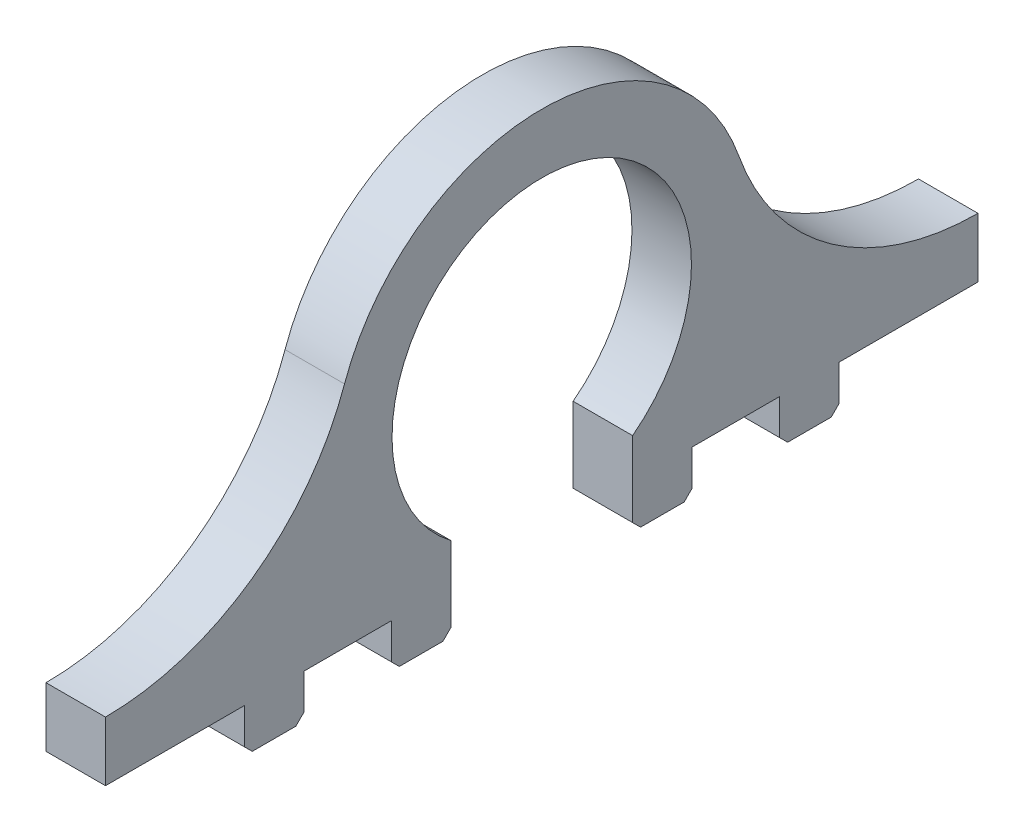
ISO-10303-21;
HEADER;
FILE_DESCRIPTION(('STEP AP214'),'2;1');
FILE_NAME('part.step','',(''),(''),'','','');
FILE_SCHEMA(('AUTOMOTIVE_DESIGN { 1 0 10303 214 1 1 1 1 }'));
ENDSEC;
DATA;
#1=APPLICATION_CONTEXT('core data for automotive mechanical design processes');
#2=APPLICATION_PROTOCOL_DEFINITION('international standard','automotive_design',2000,#1);
#3=PRODUCT_CONTEXT('',#1,'mechanical');
#4=PRODUCT('Part','Part','',(#3));
#5=PRODUCT_RELATED_PRODUCT_CATEGORY('part','',(#4));
#6=PRODUCT_DEFINITION_FORMATION('','',#4);
#7=PRODUCT_DEFINITION_CONTEXT('part definition',#1,'design');
#8=PRODUCT_DEFINITION('design','',#6,#7);
#9=PRODUCT_DEFINITION_SHAPE('','',#8);
#10=(LENGTH_UNIT() NAMED_UNIT(*) SI_UNIT(.MILLI.,.METRE.));
#11=(NAMED_UNIT(*) PLANE_ANGLE_UNIT() SI_UNIT($,.RADIAN.));
#12=(NAMED_UNIT(*) SI_UNIT($,.STERADIAN.) SOLID_ANGLE_UNIT());
#13=UNCERTAINTY_MEASURE_WITH_UNIT(LENGTH_MEASURE(1.E-05),#10,'distance_accuracy_value','');
#14=(GEOMETRIC_REPRESENTATION_CONTEXT(3) GLOBAL_UNCERTAINTY_ASSIGNED_CONTEXT((#13)) GLOBAL_UNIT_ASSIGNED_CONTEXT((#10,
#11,#12)) REPRESENTATION_CONTEXT('',''));
#15=CARTESIAN_POINT('',(0.,0.,0.));
#16=DIRECTION('',(0.,0.,1.));
#17=DIRECTION('',(1.,0.,0.));
#18=AXIS2_PLACEMENT_3D('',#15,#16,#17);
#19=CARTESIAN_POINT('',(0.,-40.,-22.9142422960045));
#20=DIRECTION('',(0.,-1.,0.));
#21=DIRECTION('',(0.,0.,-1.));
#22=AXIS2_PLACEMENT_3D('',#19,#20,#21);
#23=PLANE('',#22);
#24=CARTESIAN_POINT('',(0.,-40.,-75.));
#25=CARTESIAN_POINT('',(15.,-40.,-75.));
#26=B_SPLINE_CURVE_WITH_KNOTS('',1,(#24,#25),.UNSPECIFIED.,.F.,.F.,(2,2),(0.,0.25),.UNSPECIFIED.);
#27=CARTESIAN_POINT('',(0.,-40.,-75.));
#28=VERTEX_POINT('',#27);
#29=CARTESIAN_POINT('',(15.,-40.,-75.));
#30=VERTEX_POINT('',#29);
#31=EDGE_CURVE('E65',#28,#30,#26,.T.);
#32=ORIENTED_EDGE('',*,*,#31,.F.);
#33=DIRECTION('',(0.,0.,-1.));
#34=VECTOR('',#33,1.);
#35=CARTESIAN_POINT('',(0.,-40.,-22.9142422960045));
#36=LINE('',#35,#34);
#37=CARTESIAN_POINT('',(0.,-40.,-110.));
#38=VERTEX_POINT('',#37);
#39=EDGE_CURVE('E510',#28,#38,#36,.T.);
#40=ORIENTED_EDGE('',*,*,#39,.T.);
#41=DIRECTION('',(-1.,0.,0.));
#42=VECTOR('',#41,1.);
#43=CARTESIAN_POINT('',(0.,-40.,-110.));
#44=LINE('',#43,#42);
#45=CARTESIAN_POINT('',(15.,-40.,-110.));
#46=VERTEX_POINT('',#45);
#47=EDGE_CURVE('E564',#46,#38,#44,.T.);
#48=ORIENTED_EDGE('',*,*,#47,.F.);
#49=DIRECTION('',(0.,0.,-1.));
#50=VECTOR('',#49,1.);
#51=CARTESIAN_POINT('',(15.,-40.,0.));
#52=LINE('',#51,#50);
#53=EDGE_CURVE('E246',#30,#46,#52,.T.);
#54=ORIENTED_EDGE('',*,*,#53,.F.);
#55=EDGE_LOOP('',(#32,#40,#48,#54));
#56=FACE_BOUND('',#55,.T.);
#57=ADVANCED_FACE('F40',(#56),#23,.T.);
#58=CARTESIAN_POINT('',(0.,-40.,110.));
#59=DIRECTION('',(0.,-1.,0.));
#60=DIRECTION('',(0.,0.,-1.));
#61=AXIS2_PLACEMENT_3D('',#58,#59,#60);
#62=PLANE('',#61);
#63=DIRECTION('',(0.,0.,-1.));
#64=VECTOR('',#63,1.);
#65=CARTESIAN_POINT('',(0.,-40.,110.));
#66=LINE('',#65,#64);
#67=CARTESIAN_POINT('',(0.,-40.,60.));
#68=VERTEX_POINT('',#67);
#69=CARTESIAN_POINT('',(0.,-40.,37.9142422960045));
#70=VERTEX_POINT('',#69);
#71=EDGE_CURVE('E490',#68,#70,#66,.T.);
#72=ORIENTED_EDGE('',*,*,#71,.T.);
#73=CARTESIAN_POINT('',(0.,-40.,37.9142422960045));
#74=CARTESIAN_POINT('',(15.,-40.,37.9142422960045));
#75=B_SPLINE_CURVE_WITH_KNOTS('',1,(#73,#74),.UNSPECIFIED.,.F.,.F.,(2,2),(0.,0.25),.UNSPECIFIED.);
#76=CARTESIAN_POINT('',(15.,-40.,37.9142422960045));
#77=VERTEX_POINT('',#76);
#78=EDGE_CURVE('E369',#70,#77,#75,.T.);
#79=ORIENTED_EDGE('',*,*,#78,.T.);
#80=DIRECTION('',(0.,0.,-1.));
#81=VECTOR('',#80,1.);
#82=CARTESIAN_POINT('',(15.,-40.,0.));
#83=LINE('',#82,#81);
#84=CARTESIAN_POINT('',(15.,-40.,60.));
#85=VERTEX_POINT('',#84);
#86=EDGE_CURVE('E484',#85,#77,#83,.T.);
#87=ORIENTED_EDGE('',*,*,#86,.F.);
#88=CARTESIAN_POINT('',(15.,-40.,60.));
#89=CARTESIAN_POINT('',(0.,-40.,60.));
#90=B_SPLINE_CURVE_WITH_KNOTS('',1,(#88,#89),.UNSPECIFIED.,.F.,.F.,(2,2),(0.5,0.75),.UNSPECIFIED.);
#91=EDGE_CURVE('E432',#85,#68,#90,.T.);
#92=ORIENTED_EDGE('',*,*,#91,.T.);
#93=EDGE_LOOP('',(#72,#79,#87,#92));
#94=FACE_BOUND('',#93,.T.);
#95=ADVANCED_FACE('F632',(#94),#62,.T.);
#96=CARTESIAN_POINT('',(0.,-40.,110.));
#97=VERTEX_POINT('',#96);
#98=CARTESIAN_POINT('',(0.,-40.,75.));
#99=VERTEX_POINT('',#98);
#100=EDGE_CURVE('E485',#97,#99,#66,.T.);
#101=ORIENTED_EDGE('',*,*,#100,.T.);
#102=CARTESIAN_POINT('',(0.,-40.,75.));
#103=CARTESIAN_POINT('',(15.,-40.,75.));
#104=B_SPLINE_CURVE_WITH_KNOTS('',1,(#102,#103),.UNSPECIFIED.,.F.,.F.,(2,2),(0.,0.25),.UNSPECIFIED.);
#105=CARTESIAN_POINT('',(15.,-40.,75.));
#106=VERTEX_POINT('',#105);
#107=EDGE_CURVE('E420',#99,#106,#104,.T.);
#108=ORIENTED_EDGE('',*,*,#107,.T.);
#109=CARTESIAN_POINT('',(15.,-40.,110.));
#110=VERTEX_POINT('',#109);
#111=EDGE_CURVE('E525',#110,#106,#83,.T.);
#112=ORIENTED_EDGE('',*,*,#111,.F.);
#113=DIRECTION('',(-1.,0.,0.));
#114=VECTOR('',#113,1.);
#115=CARTESIAN_POINT('',(0.,-40.,110.));
#116=LINE('',#115,#114);
#117=EDGE_CURVE('E44',#110,#97,#116,.T.);
#118=ORIENTED_EDGE('',*,*,#117,.T.);
#119=EDGE_LOOP('',(#101,#108,#112,#118));
#120=FACE_BOUND('',#119,.T.);
#121=ADVANCED_FACE('F637',(#120),#62,.T.);
#122=CARTESIAN_POINT('',(0.,38.9385048231511,110.));
#123=DIRECTION('',(1.,0.,0.));
#124=DIRECTION('',(0.,0.,-1.));
#125=AXIS2_PLACEMENT_3D('',#122,#123,#124);
#126=CYLINDRICAL_SURFACE('',#125,63.9385048231511);
#127=DIRECTION('',(-1.,0.,0.));
#128=VECTOR('',#127,1.);
#129=CARTESIAN_POINT('',(0.,-25.,110.));
#130=LINE('',#129,#128);
#131=CARTESIAN_POINT('',(15.,-25.,110.));
#132=VERTEX_POINT('',#131);
#133=CARTESIAN_POINT('',(0.,-25.,110.));
#134=VERTEX_POINT('',#133);
#135=EDGE_CURVE('E11',#132,#134,#130,.T.);
#136=ORIENTED_EDGE('',*,*,#135,.F.);
#137=CARTESIAN_POINT('',(15.,38.9385048231511,110.));
#138=DIRECTION('',(-1.,0.,0.));
#139=DIRECTION('',(0.,0.,1.));
#140=AXIS2_PLACEMENT_3D('',#137,#138,#139);
#141=CIRCLE('',#140,63.9385048231511);
#142=CARTESIAN_POINT('',(15.,17.6024719190138,49.726406288212));
#143=VERTEX_POINT('',#142);
#144=EDGE_CURVE('E551',#143,#132,#141,.T.);
#145=ORIENTED_EDGE('',*,*,#144,.F.);
#146=DIRECTION('',(-1.,0.,0.));
#147=VECTOR('',#146,1.);
#148=CARTESIAN_POINT('',(0.,17.6024719190138,49.726406288212));
#149=LINE('',#148,#147);
#150=CARTESIAN_POINT('',(0.,17.6024719190138,49.726406288212));
#151=VERTEX_POINT('',#150);
#152=EDGE_CURVE('E50',#143,#151,#149,.T.);
#153=ORIENTED_EDGE('',*,*,#152,.T.);
#154=CARTESIAN_POINT('',(0.,38.9385048231511,110.));
#155=DIRECTION('',(-1.,0.,0.));
#156=DIRECTION('',(0.,0.,-1.));
#157=AXIS2_PLACEMENT_3D('',#154,#155,#156);
#158=CIRCLE('',#157,63.9385048231511);
#159=EDGE_CURVE('E494',#151,#134,#158,.T.);
#160=ORIENTED_EDGE('',*,*,#159,.T.);
#161=EDGE_LOOP('',(#136,#145,#153,#160));
#162=FACE_BOUND('',#161,.T.);
#163=ADVANCED_FACE('F579',(#162),#126,.F.);
#164=CARTESIAN_POINT('',(0.,0.,0.));
#165=DIRECTION('',(1.,0.,0.));
#166=DIRECTION('',(0.,0.,-1.));
#167=AXIS2_PLACEMENT_3D('',#164,#165,#166);
#168=CYLINDRICAL_SURFACE('',#167,52.75);
#169=ORIENTED_EDGE('',*,*,#152,.F.);
#170=CARTESIAN_POINT('',(15.,0.,0.));
#171=DIRECTION('',(1.,0.,0.));
#172=DIRECTION('',(0.,0.,-1.));
#173=AXIS2_PLACEMENT_3D('',#170,#171,#172);
#174=CIRCLE('',#173,52.75);
#175=CARTESIAN_POINT('',(15.,17.6024719190138,-49.726406288212));
#176=VERTEX_POINT('',#175);
#177=EDGE_CURVE('E547',#176,#143,#174,.T.);
#178=ORIENTED_EDGE('',*,*,#177,.F.);
#179=DIRECTION('',(-1.,0.,0.));
#180=VECTOR('',#179,1.);
#181=CARTESIAN_POINT('',(0.,17.6024719190138,-49.726406288212));
#182=LINE('',#181,#180);
#183=CARTESIAN_POINT('',(0.,17.6024719190138,-49.726406288212));
#184=VERTEX_POINT('',#183);
#185=EDGE_CURVE('E571',#176,#184,#182,.T.);
#186=ORIENTED_EDGE('',*,*,#185,.T.);
#187=CARTESIAN_POINT('',(0.,0.,0.));
#188=DIRECTION('',(1.,0.,0.));
#189=DIRECTION('',(0.,0.,1.));
#190=AXIS2_PLACEMENT_3D('',#187,#188,#189);
#191=CIRCLE('',#190,52.75);
#192=EDGE_CURVE('E498',#184,#151,#191,.T.);
#193=ORIENTED_EDGE('',*,*,#192,.T.);
#194=EDGE_LOOP('',(#169,#178,#186,#193));
#195=FACE_BOUND('',#194,.T.);
#196=ADVANCED_FACE('F588',(#195),#168,.T.);
#197=CARTESIAN_POINT('',(0.,38.9385048231511,-110.));
#198=DIRECTION('',(1.,0.,0.));
#199=DIRECTION('',(0.,0.,-1.));
#200=AXIS2_PLACEMENT_3D('',#197,#198,#199);
#201=CYLINDRICAL_SURFACE('',#200,63.9385048231511);
#202=ORIENTED_EDGE('',*,*,#185,.F.);
#203=CARTESIAN_POINT('',(15.,38.9385048231511,-110.));
#204=DIRECTION('',(-1.,0.,0.));
#205=DIRECTION('',(0.,0.,1.));
#206=AXIS2_PLACEMENT_3D('',#203,#204,#205);
#207=CIRCLE('',#206,63.9385048231511);
#208=CARTESIAN_POINT('',(15.,-25.,-110.));
#209=VERTEX_POINT('',#208);
#210=EDGE_CURVE('E543',#209,#176,#207,.T.);
#211=ORIENTED_EDGE('',*,*,#210,.F.);
#212=DIRECTION('',(-1.,0.,0.));
#213=VECTOR('',#212,1.);
#214=CARTESIAN_POINT('',(0.,-25.,-110.));
#215=LINE('',#214,#213);
#216=CARTESIAN_POINT('',(0.,-25.,-110.));
#217=VERTEX_POINT('',#216);
#218=EDGE_CURVE('E568',#209,#217,#215,.T.);
#219=ORIENTED_EDGE('',*,*,#218,.T.);
#220=CARTESIAN_POINT('',(0.,38.9385048231511,-110.));
#221=DIRECTION('',(-1.,0.,0.));
#222=DIRECTION('',(0.,0.,1.));
#223=AXIS2_PLACEMENT_3D('',#220,#221,#222);
#224=CIRCLE('',#223,63.9385048231511);
#225=EDGE_CURVE('E502',#217,#184,#224,.T.);
#226=ORIENTED_EDGE('',*,*,#225,.T.);
#227=EDGE_LOOP('',(#202,#211,#219,#226));
#228=FACE_BOUND('',#227,.T.);
#229=ADVANCED_FACE('F591',(#228),#201,.F.);
#230=CARTESIAN_POINT('',(0.,-40.,-110.));
#231=DIRECTION('',(0.,0.,-1.));
#232=DIRECTION('',(0.,1.,0.));
#233=AXIS2_PLACEMENT_3D('',#230,#231,#232);
#234=PLANE('',#233);
#235=ORIENTED_EDGE('',*,*,#218,.F.);
#236=DIRECTION('',(0.,1.,0.));
#237=VECTOR('',#236,1.);
#238=CARTESIAN_POINT('',(15.,0.,-110.));
#239=LINE('',#238,#237);
#240=EDGE_CURVE('E539',#46,#209,#239,.T.);
#241=ORIENTED_EDGE('',*,*,#240,.F.);
#242=ORIENTED_EDGE('',*,*,#47,.T.);
#243=DIRECTION('',(0.,1.,0.));
#244=VECTOR('',#243,1.);
#245=CARTESIAN_POINT('',(0.,-40.,-110.));
#246=LINE('',#245,#244);
#247=EDGE_CURVE('E506',#38,#217,#246,.T.);
#248=ORIENTED_EDGE('',*,*,#247,.T.);
#249=EDGE_LOOP('',(#235,#241,#242,#248));
#250=FACE_BOUND('',#249,.T.);
#251=ADVANCED_FACE('F595',(#250),#234,.T.);
#252=CARTESIAN_POINT('',(0.,-40.,-37.9142422960045));
#253=CARTESIAN_POINT('',(15.,-40.,-37.9142422960045));
#254=B_SPLINE_CURVE_WITH_KNOTS('',1,(#252,#253),.UNSPECIFIED.,.F.,.F.,(2,2),(0.,0.25),.UNSPECIFIED.);
#255=CARTESIAN_POINT('',(0.,-40.,-37.9142422960045));
#256=VERTEX_POINT('',#255);
#257=CARTESIAN_POINT('',(15.,-40.,-37.9142422960045));
#258=VERTEX_POINT('',#257);
#259=EDGE_CURVE('E57',#256,#258,#254,.T.);
#260=ORIENTED_EDGE('',*,*,#259,.F.);
#261=CARTESIAN_POINT('',(0.,-40.,-60.));
#262=VERTEX_POINT('',#261);
#263=EDGE_CURVE('E511',#256,#262,#36,.T.);
#264=ORIENTED_EDGE('',*,*,#263,.T.);
#265=CARTESIAN_POINT('',(15.,-40.,-60.));
#266=CARTESIAN_POINT('',(0.,-40.,-60.));
#267=B_SPLINE_CURVE_WITH_KNOTS('',1,(#265,#266),.UNSPECIFIED.,.F.,.F.,(2,2),(0.5,0.75),.UNSPECIFIED.);
#268=CARTESIAN_POINT('',(15.,-40.,-60.));
#269=VERTEX_POINT('',#268);
#270=EDGE_CURVE('E240',#269,#262,#267,.T.);
#271=ORIENTED_EDGE('',*,*,#270,.F.);
#272=EDGE_CURVE('E236',#258,#269,#52,.T.);
#273=ORIENTED_EDGE('',*,*,#272,.F.);
#274=EDGE_LOOP('',(#260,#264,#271,#273));
#275=FACE_BOUND('',#274,.T.);
#276=ADVANCED_FACE('F238',(#275),#23,.T.);
#277=CARTESIAN_POINT('',(0.,-30.,-22.9142422960045));
#278=DIRECTION('',(0.,0.,1.));
#279=DIRECTION('',(0.,-1.,0.));
#280=AXIS2_PLACEMENT_3D('',#277,#278,#279);
#281=PLANE('',#280);
#282=DIRECTION('',(0.,-1.,0.));
#283=VECTOR('',#282,1.);
#284=CARTESIAN_POINT('',(0.,-30.,-22.9142422960045));
#285=LINE('',#284,#283);
#286=CARTESIAN_POINT('',(0.,-30.,-22.9142422960045));
#287=VERTEX_POINT('',#286);
#288=CARTESIAN_POINT('',(0.,-49.,-22.9142422960045));
#289=VERTEX_POINT('',#288);
#290=EDGE_CURVE('E514',#287,#289,#285,.T.);
#291=ORIENTED_EDGE('',*,*,#290,.T.);
#292=DIRECTION('',(1.,0.,0.));
#293=VECTOR('',#292,1.);
#294=CARTESIAN_POINT('',(15.,-49.,-22.9142422960045));
#295=LINE('',#294,#293);
#296=CARTESIAN_POINT('',(15.,-49.,-22.9142422960045));
#297=VERTEX_POINT('',#296);
#298=EDGE_CURVE('E302',#289,#297,#295,.T.);
#299=ORIENTED_EDGE('',*,*,#298,.T.);
#300=DIRECTION('',(0.,1.,0.));
#301=VECTOR('',#300,1.);
#302=CARTESIAN_POINT('',(15.,0.,-22.9142422960045));
#303=LINE('',#302,#301);
#304=CARTESIAN_POINT('',(15.,-30.,-22.9142422960045));
#305=VERTEX_POINT('',#304);
#306=EDGE_CURVE('E245',#305,#297,#303,.F.);
#307=ORIENTED_EDGE('',*,*,#306,.F.);
#308=DIRECTION('',(-1.,0.,0.));
#309=VECTOR('',#308,1.);
#310=CARTESIAN_POINT('',(0.,-30.,-22.9142422960045));
#311=LINE('',#310,#309);
#312=EDGE_CURVE('E561',#305,#287,#311,.T.);
#313=ORIENTED_EDGE('',*,*,#312,.T.);
#314=EDGE_LOOP('',(#291,#299,#307,#313));
#315=FACE_BOUND('',#314,.T.);
#316=ADVANCED_FACE('F643',(#315),#281,.T.);
#317=CARTESIAN_POINT('',(0.,0.,0.));
#318=DIRECTION('',(1.,0.,0.));
#319=DIRECTION('',(0.,0.,-1.));
#320=AXIS2_PLACEMENT_3D('',#317,#318,#319);
#321=CYLINDRICAL_SURFACE('',#320,37.75);
#322=ORIENTED_EDGE('',*,*,#312,.F.);
#323=CARTESIAN_POINT('',(15.,0.,0.));
#324=DIRECTION('',(-1.,0.,0.));
#325=DIRECTION('',(0.,0.,1.));
#326=AXIS2_PLACEMENT_3D('',#323,#324,#325);
#327=CIRCLE('',#326,37.75);
#328=CARTESIAN_POINT('',(15.,-30.,22.9142422960045));
#329=VERTEX_POINT('',#328);
#330=EDGE_CURVE('E533',#329,#305,#327,.T.);
#331=ORIENTED_EDGE('',*,*,#330,.F.);
#332=DIRECTION('',(-1.,0.,0.));
#333=VECTOR('',#332,1.);
#334=CARTESIAN_POINT('',(0.,-30.,22.9142422960045));
#335=LINE('',#334,#333);
#336=CARTESIAN_POINT('',(0.,-30.,22.9142422960045));
#337=VERTEX_POINT('',#336);
#338=EDGE_CURVE('E558',#329,#337,#335,.T.);
#339=ORIENTED_EDGE('',*,*,#338,.T.);
#340=CARTESIAN_POINT('',(0.,0.,0.));
#341=DIRECTION('',(-1.,0.,0.));
#342=DIRECTION('',(0.,0.,-1.));
#343=AXIS2_PLACEMENT_3D('',#340,#341,#342);
#344=CIRCLE('',#343,37.75);
#345=EDGE_CURVE('E517',#337,#287,#344,.T.);
#346=ORIENTED_EDGE('',*,*,#345,.T.);
#347=EDGE_LOOP('',(#322,#331,#339,#346));
#348=FACE_BOUND('',#347,.T.);
#349=ADVANCED_FACE('F648',(#348),#321,.F.);
#350=CARTESIAN_POINT('',(0.,-30.,22.9142422960045));
#351=DIRECTION('',(0.,0.,-1.));
#352=DIRECTION('',(0.,1.,0.));
#353=AXIS2_PLACEMENT_3D('',#350,#351,#352);
#354=PLANE('',#353);
#355=ORIENTED_EDGE('',*,*,#338,.F.);
#356=DIRECTION('',(0.,1.,0.));
#357=VECTOR('',#356,1.);
#358=CARTESIAN_POINT('',(15.,0.,22.9142422960045));
#359=LINE('',#358,#357);
#360=CARTESIAN_POINT('',(15.,-49.,22.9142422960045));
#361=VERTEX_POINT('',#360);
#362=EDGE_CURVE('E529',#361,#329,#359,.T.);
#363=ORIENTED_EDGE('',*,*,#362,.F.);
#364=DIRECTION('',(-1.,0.,0.));
#365=VECTOR('',#364,1.);
#366=CARTESIAN_POINT('',(0.,-49.,22.9142422960045));
#367=LINE('',#366,#365);
#368=CARTESIAN_POINT('',(0.,-49.,22.9142422960045));
#369=VERTEX_POINT('',#368);
#370=EDGE_CURVE('E407',#361,#369,#367,.T.);
#371=ORIENTED_EDGE('',*,*,#370,.T.);
#372=DIRECTION('',(0.,1.,0.));
#373=VECTOR('',#372,1.);
#374=CARTESIAN_POINT('',(0.,-30.,22.9142422960045));
#375=LINE('',#374,#373);
#376=EDGE_CURVE('E521',#369,#337,#375,.T.);
#377=ORIENTED_EDGE('',*,*,#376,.T.);
#378=EDGE_LOOP('',(#355,#363,#371,#377));
#379=FACE_BOUND('',#378,.T.);
#380=ADVANCED_FACE('F666',(#379),#354,.T.);
#381=CARTESIAN_POINT('',(0.,-40.,110.));
#382=DIRECTION('',(0.,0.,1.));
#383=DIRECTION('',(0.,-1.,0.));
#384=AXIS2_PLACEMENT_3D('',#381,#382,#383);
#385=PLANE('',#384);
#386=DIRECTION('',(0.,1.,0.));
#387=VECTOR('',#386,1.);
#388=CARTESIAN_POINT('',(15.,0.,110.));
#389=LINE('',#388,#387);
#390=EDGE_CURVE('E528',#132,#110,#389,.F.);
#391=ORIENTED_EDGE('',*,*,#390,.F.);
#392=ORIENTED_EDGE('',*,*,#135,.T.);
#393=DIRECTION('',(0.,-1.,0.));
#394=VECTOR('',#393,1.);
#395=CARTESIAN_POINT('',(0.,-40.,110.));
#396=LINE('',#395,#394);
#397=EDGE_CURVE('E489',#134,#97,#396,.T.);
#398=ORIENTED_EDGE('',*,*,#397,.T.);
#399=ORIENTED_EDGE('',*,*,#117,.F.);
#400=EDGE_LOOP('',(#391,#392,#398,#399));
#401=FACE_BOUND('',#400,.T.);
#402=ADVANCED_FACE('F42',(#401),#385,.T.);
#403=CARTESIAN_POINT('',(0.,0.,0.));
#404=DIRECTION('',(1.,0.,0.));
#405=DIRECTION('',(0.,0.,-1.));
#406=AXIS2_PLACEMENT_3D('',#403,#404,#405);
#407=PLANE('',#406);
#408=ORIENTED_EDGE('',*,*,#100,.F.);
#409=ORIENTED_EDGE('',*,*,#397,.F.);
#410=ORIENTED_EDGE('',*,*,#159,.F.);
#411=ORIENTED_EDGE('',*,*,#192,.F.);
#412=ORIENTED_EDGE('',*,*,#225,.F.);
#413=ORIENTED_EDGE('',*,*,#247,.F.);
#414=ORIENTED_EDGE('',*,*,#39,.F.);
#415=DIRECTION('',(0.,1.,0.));
#416=VECTOR('',#415,1.);
#417=CARTESIAN_POINT('',(0.,-61.9999999999999,-75.));
#418=LINE('',#417,#416);
#419=CARTESIAN_POINT('',(0.,-49.,-75.));
#420=VERTEX_POINT('',#419);
#421=EDGE_CURVE('E323',#420,#28,#418,.T.);
#422=ORIENTED_EDGE('',*,*,#421,.F.);
#423=DIRECTION('',(0.,0.707106781186548,-0.707106781186548));
#424=VECTOR('',#423,1.);
#425=CARTESIAN_POINT('',(0.,-49.,-75.));
#426=LINE('',#425,#424);
#427=CARTESIAN_POINT('',(0.,-51.,-73.));
#428=VERTEX_POINT('',#427);
#429=EDGE_CURVE('E350',#420,#428,#426,.F.);
#430=ORIENTED_EDGE('',*,*,#429,.T.);
#431=DIRECTION('',(0.,0.,1.));
#432=VECTOR('',#431,1.);
#433=CARTESIAN_POINT('',(0.,-51.,-60.));
#434=LINE('',#433,#432);
#435=CARTESIAN_POINT('',(0.,-51.,-62.));
#436=VERTEX_POINT('',#435);
#437=EDGE_CURVE('E311',#428,#436,#434,.T.);
#438=ORIENTED_EDGE('',*,*,#437,.T.);
#439=DIRECTION('',(0.,-0.707106781186548,-0.707106781186548));
#440=VECTOR('',#439,1.);
#441=CARTESIAN_POINT('',(0.,-49.,-60.));
#442=LINE('',#441,#440);
#443=CARTESIAN_POINT('',(0.,-49.,-60.));
#444=VERTEX_POINT('',#443);
#445=EDGE_CURVE('E347',#436,#444,#442,.F.);
#446=ORIENTED_EDGE('',*,*,#445,.T.);
#447=DIRECTION('',(0.,1.,0.));
#448=VECTOR('',#447,1.);
#449=CARTESIAN_POINT('',(0.,-61.9999999999999,-60.));
#450=LINE('',#449,#448);
#451=EDGE_CURVE('E330',#444,#262,#450,.T.);
#452=ORIENTED_EDGE('',*,*,#451,.T.);
#453=ORIENTED_EDGE('',*,*,#263,.F.);
#454=DIRECTION('',(0.,1.,0.));
#455=VECTOR('',#454,1.);
#456=CARTESIAN_POINT('',(0.,-61.9999999999999,-37.9142422960045));
#457=LINE('',#456,#455);
#458=CARTESIAN_POINT('',(0.,-49.,-37.9142422960045));
#459=VERTEX_POINT('',#458);
#460=EDGE_CURVE('E260',#459,#256,#457,.T.);
#461=ORIENTED_EDGE('',*,*,#460,.F.);
#462=DIRECTION('',(0.,0.707106781186548,-0.707106781186548));
#463=VECTOR('',#462,1.);
#464=CARTESIAN_POINT('',(0.,-49.,-37.9142422960045));
#465=LINE('',#464,#463);
#466=CARTESIAN_POINT('',(0.,-51.,-35.9142422960045));
#467=VERTEX_POINT('',#466);
#468=EDGE_CURVE('E288',#459,#467,#465,.F.);
#469=ORIENTED_EDGE('',*,*,#468,.T.);
#470=DIRECTION('',(0.,0.,1.));
#471=VECTOR('',#470,1.);
#472=CARTESIAN_POINT('',(0.,-51.,-22.9142422960045));
#473=LINE('',#472,#471);
#474=CARTESIAN_POINT('',(0.,-51.,-24.9142422960045));
#475=VERTEX_POINT('',#474);
#476=EDGE_CURVE('E259',#467,#475,#473,.T.);
#477=ORIENTED_EDGE('',*,*,#476,.T.);
#478=DIRECTION('',(0.,-0.707106781186547,-0.707106781186548));
#479=VECTOR('',#478,1.);
#480=CARTESIAN_POINT('',(0.,-49.,-22.9142422960045));
#481=LINE('',#480,#479);
#482=EDGE_CURVE('E284',#475,#289,#481,.F.);
#483=ORIENTED_EDGE('',*,*,#482,.T.);
#484=ORIENTED_EDGE('',*,*,#290,.F.);
#485=ORIENTED_EDGE('',*,*,#345,.F.);
#486=ORIENTED_EDGE('',*,*,#376,.F.);
#487=DIRECTION('',(0.,-0.707106781186549,0.707106781186546));
#488=VECTOR('',#487,1.);
#489=CARTESIAN_POINT('',(0.,-55.5,29.4142422960045));
#490=LINE('',#489,#488);
#491=CARTESIAN_POINT('',(0.,-51.,24.9142422960045));
#492=VERTEX_POINT('',#491);
#493=EDGE_CURVE('E414',#369,#492,#490,.T.);
#494=ORIENTED_EDGE('',*,*,#493,.T.);
#495=DIRECTION('',(0.,0.,-1.));
#496=VECTOR('',#495,1.);
#497=CARTESIAN_POINT('',(0.,-51.,22.9142422960045));
#498=LINE('',#497,#496);
#499=CARTESIAN_POINT('',(0.,-51.,35.9142422960045));
#500=VERTEX_POINT('',#499);
#501=EDGE_CURVE('E370',#500,#492,#498,.T.);
#502=ORIENTED_EDGE('',*,*,#501,.F.);
#503=DIRECTION('',(0.,0.707106781186549,0.707106781186546));
#504=VECTOR('',#503,1.);
#505=CARTESIAN_POINT('',(0.,-63.,23.9142422960046));
#506=LINE('',#505,#504);
#507=CARTESIAN_POINT('',(0.,-49.,37.9142422960045));
#508=VERTEX_POINT('',#507);
#509=EDGE_CURVE('E411',#500,#508,#506,.T.);
#510=ORIENTED_EDGE('',*,*,#509,.T.);
#511=DIRECTION('',(0.,1.,0.));
#512=VECTOR('',#511,1.);
#513=CARTESIAN_POINT('',(0.,-61.9999999999999,37.9142422960045));
#514=LINE('',#513,#512);
#515=EDGE_CURVE('E375',#508,#70,#514,.T.);
#516=ORIENTED_EDGE('',*,*,#515,.T.);
#517=ORIENTED_EDGE('',*,*,#71,.F.);
#518=DIRECTION('',(0.,1.,0.));
#519=VECTOR('',#518,1.);
#520=CARTESIAN_POINT('',(0.,-62.,60.));
#521=LINE('',#520,#519);
#522=CARTESIAN_POINT('',(0.,-49.,60.));
#523=VERTEX_POINT('',#522);
#524=EDGE_CURVE('E447',#523,#68,#521,.T.);
#525=ORIENTED_EDGE('',*,*,#524,.F.);
#526=DIRECTION('',(0.,-0.707106781186546,0.707106781186549));
#527=VECTOR('',#526,1.);
#528=CARTESIAN_POINT('',(0.,-55.4999999999999,66.5));
#529=LINE('',#528,#527);
#530=CARTESIAN_POINT('',(0.,-51.,62.));
#531=VERTEX_POINT('',#530);
#532=EDGE_CURVE('E478',#523,#531,#529,.T.);
#533=ORIENTED_EDGE('',*,*,#532,.T.);
#534=DIRECTION('',(0.,0.,-1.));
#535=VECTOR('',#534,1.);
#536=CARTESIAN_POINT('',(0.,-51.,60.));
#537=LINE('',#536,#535);
#538=CARTESIAN_POINT('',(0.,-51.,73.));
#539=VERTEX_POINT('',#538);
#540=EDGE_CURVE('E421',#539,#531,#537,.T.);
#541=ORIENTED_EDGE('',*,*,#540,.F.);
#542=DIRECTION('',(0.,0.707106781186548,0.707106781186548));
#543=VECTOR('',#542,1.);
#544=CARTESIAN_POINT('',(0.,-63.,61.));
#545=LINE('',#544,#543);
#546=CARTESIAN_POINT('',(0.,-49.,75.));
#547=VERTEX_POINT('',#546);
#548=EDGE_CURVE('E475',#539,#547,#545,.T.);
#549=ORIENTED_EDGE('',*,*,#548,.T.);
#550=DIRECTION('',(0.,1.,0.));
#551=VECTOR('',#550,1.);
#552=CARTESIAN_POINT('',(0.,-62.,75.));
#553=LINE('',#552,#551);
#554=EDGE_CURVE('E426',#547,#99,#553,.T.);
#555=ORIENTED_EDGE('',*,*,#554,.T.);
#556=EDGE_LOOP('',(#408,#409,#410,#411,#412,#413,#414,#422,#430,#438,#446,#452,#453,#461,#469,
#477,#483,#484,#485,#486,#494,#502,#510,#516,#517,#525,#533,#541,#549,#555));
#557=FACE_BOUND('',#556,.T.);
#558=ADVANCED_FACE('F586',(#557),#407,.F.);
#559=CARTESIAN_POINT('',(15.,0.,0.));
#560=DIRECTION('',(1.,0.,0.));
#561=DIRECTION('',(0.,0.,-1.));
#562=AXIS2_PLACEMENT_3D('',#559,#560,#561);
#563=PLANE('',#562);
#564=ORIENTED_EDGE('',*,*,#111,.T.);
#565=DIRECTION('',(0.,1.,0.));
#566=VECTOR('',#565,1.);
#567=CARTESIAN_POINT('',(15.,-62.,75.));
#568=LINE('',#567,#566);
#569=CARTESIAN_POINT('',(15.,-49.,75.));
#570=VERTEX_POINT('',#569);
#571=EDGE_CURVE('E441',#570,#106,#568,.T.);
#572=ORIENTED_EDGE('',*,*,#571,.F.);
#573=DIRECTION('',(0.,-0.707106781186548,-0.707106781186548));
#574=VECTOR('',#573,1.);
#575=CARTESIAN_POINT('',(15.,-55.5,68.5));
#576=LINE('',#575,#574);
#577=CARTESIAN_POINT('',(15.,-51.,73.));
#578=VERTEX_POINT('',#577);
#579=EDGE_CURVE('E466',#570,#578,#576,.T.);
#580=ORIENTED_EDGE('',*,*,#579,.T.);
#581=DIRECTION('',(0.,0.,1.));
#582=VECTOR('',#581,1.);
#583=CARTESIAN_POINT('',(15.,-51.,75.));
#584=LINE('',#583,#582);
#585=CARTESIAN_POINT('',(15.,-51.,62.));
#586=VERTEX_POINT('',#585);
#587=EDGE_CURVE('E425',#586,#578,#584,.T.);
#588=ORIENTED_EDGE('',*,*,#587,.F.);
#589=DIRECTION('',(0.,0.707106781186546,-0.707106781186549));
#590=VECTOR('',#589,1.);
#591=CARTESIAN_POINT('',(15.,-62.9999999999999,74.));
#592=LINE('',#591,#590);
#593=CARTESIAN_POINT('',(15.,-49.,60.));
#594=VERTEX_POINT('',#593);
#595=EDGE_CURVE('E469',#586,#594,#592,.T.);
#596=ORIENTED_EDGE('',*,*,#595,.T.);
#597=DIRECTION('',(0.,1.,0.));
#598=VECTOR('',#597,1.);
#599=CARTESIAN_POINT('',(15.,-62.,60.));
#600=LINE('',#599,#598);
#601=EDGE_CURVE('E450',#594,#85,#600,.T.);
#602=ORIENTED_EDGE('',*,*,#601,.T.);
#603=ORIENTED_EDGE('',*,*,#86,.T.);
#604=DIRECTION('',(0.,1.,0.));
#605=VECTOR('',#604,1.);
#606=CARTESIAN_POINT('',(15.,-61.9999999999999,37.9142422960045));
#607=LINE('',#606,#605);
#608=CARTESIAN_POINT('',(15.,-49.,37.9142422960045));
#609=VERTEX_POINT('',#608);
#610=EDGE_CURVE('E381',#609,#77,#607,.T.);
#611=ORIENTED_EDGE('',*,*,#610,.F.);
#612=DIRECTION('',(0.,-0.707106781186549,-0.707106781186546));
#613=VECTOR('',#612,1.);
#614=CARTESIAN_POINT('',(15.,-55.5,31.4142422960045));
#615=LINE('',#614,#613);
#616=CARTESIAN_POINT('',(15.,-51.,35.9142422960045));
#617=VERTEX_POINT('',#616);
#618=EDGE_CURVE('E400',#609,#617,#615,.T.);
#619=ORIENTED_EDGE('',*,*,#618,.T.);
#620=DIRECTION('',(0.,0.,1.));
#621=VECTOR('',#620,1.);
#622=CARTESIAN_POINT('',(15.,-51.,37.9142422960045));
#623=LINE('',#622,#621);
#624=CARTESIAN_POINT('',(15.,-51.,24.9142422960045));
#625=VERTEX_POINT('',#624);
#626=EDGE_CURVE('E374',#625,#617,#623,.T.);
#627=ORIENTED_EDGE('',*,*,#626,.F.);
#628=DIRECTION('',(0.,0.707106781186549,-0.707106781186546));
#629=VECTOR('',#628,1.);
#630=CARTESIAN_POINT('',(15.,-63.,36.9142422960045));
#631=LINE('',#630,#629);
#632=EDGE_CURVE('E403',#625,#361,#631,.T.);
#633=ORIENTED_EDGE('',*,*,#632,.T.);
#634=ORIENTED_EDGE('',*,*,#362,.T.);
#635=ORIENTED_EDGE('',*,*,#330,.T.);
#636=ORIENTED_EDGE('',*,*,#306,.T.);
#637=DIRECTION('',(0.,0.707106781186547,0.707106781186548));
#638=VECTOR('',#637,1.);
#639=CARTESIAN_POINT('',(15.,-49.,-22.9142422960045));
#640=LINE('',#639,#638);
#641=CARTESIAN_POINT('',(15.,-51.,-24.9142422960045));
#642=VERTEX_POINT('',#641);
#643=EDGE_CURVE('E297',#297,#642,#640,.F.);
#644=ORIENTED_EDGE('',*,*,#643,.T.);
#645=DIRECTION('',(0.,0.,-1.));
#646=VECTOR('',#645,1.);
#647=CARTESIAN_POINT('',(15.,-51.,-37.9142422960045));
#648=LINE('',#647,#646);
#649=CARTESIAN_POINT('',(15.,-51.,-35.9142422960045));
#650=VERTEX_POINT('',#649);
#651=EDGE_CURVE('E273',#642,#650,#648,.T.);
#652=ORIENTED_EDGE('',*,*,#651,.T.);
#653=DIRECTION('',(0.,-0.707106781186548,0.707106781186548));
#654=VECTOR('',#653,1.);
#655=CARTESIAN_POINT('',(15.,-49.,-37.9142422960045));
#656=LINE('',#655,#654);
#657=CARTESIAN_POINT('',(15.,-49.,-37.9142422960045));
#658=VERTEX_POINT('',#657);
#659=EDGE_CURVE('E254',#650,#658,#656,.F.);
#660=ORIENTED_EDGE('',*,*,#659,.T.);
#661=DIRECTION('',(0.,1.,0.));
#662=VECTOR('',#661,1.);
#663=CARTESIAN_POINT('',(15.,-61.9999999999999,-37.9142422960045));
#664=LINE('',#663,#662);
#665=EDGE_CURVE('E249',#658,#258,#664,.T.);
#666=ORIENTED_EDGE('',*,*,#665,.T.);
#667=ORIENTED_EDGE('',*,*,#272,.T.);
#668=DIRECTION('',(0.,1.,0.));
#669=VECTOR('',#668,1.);
#670=CARTESIAN_POINT('',(15.,-61.9999999999999,-60.));
#671=LINE('',#670,#669);
#672=CARTESIAN_POINT('',(15.,-49.,-60.));
#673=VERTEX_POINT('',#672);
#674=EDGE_CURVE('E334',#673,#269,#671,.T.);
#675=ORIENTED_EDGE('',*,*,#674,.F.);
#676=DIRECTION('',(0.,0.707106781186548,0.707106781186548));
#677=VECTOR('',#676,1.);
#678=CARTESIAN_POINT('',(15.,-49.,-60.));
#679=LINE('',#678,#677);
#680=CARTESIAN_POINT('',(15.,-51.,-62.));
#681=VERTEX_POINT('',#680);
#682=EDGE_CURVE('E359',#673,#681,#679,.F.);
#683=ORIENTED_EDGE('',*,*,#682,.T.);
#684=DIRECTION('',(0.,0.,-1.));
#685=VECTOR('',#684,1.);
#686=CARTESIAN_POINT('',(15.,-51.,-75.));
#687=LINE('',#686,#685);
#688=CARTESIAN_POINT('',(15.,-51.,-73.));
#689=VERTEX_POINT('',#688);
#690=EDGE_CURVE('E306',#681,#689,#687,.T.);
#691=ORIENTED_EDGE('',*,*,#690,.T.);
#692=DIRECTION('',(0.,-0.707106781186548,0.707106781186548));
#693=VECTOR('',#692,1.);
#694=CARTESIAN_POINT('',(15.,-49.,-75.));
#695=LINE('',#694,#693);
#696=CARTESIAN_POINT('',(15.,-49.,-75.));
#697=VERTEX_POINT('',#696);
#698=EDGE_CURVE('E362',#689,#697,#695,.F.);
#699=ORIENTED_EDGE('',*,*,#698,.T.);
#700=DIRECTION('',(0.,1.,0.));
#701=VECTOR('',#700,1.);
#702=CARTESIAN_POINT('',(15.,-61.9999999999999,-75.));
#703=LINE('',#702,#701);
#704=EDGE_CURVE('E337',#697,#30,#703,.T.);
#705=ORIENTED_EDGE('',*,*,#704,.T.);
#706=ORIENTED_EDGE('',*,*,#53,.T.);
#707=ORIENTED_EDGE('',*,*,#240,.T.);
#708=ORIENTED_EDGE('',*,*,#210,.T.);
#709=ORIENTED_EDGE('',*,*,#177,.T.);
#710=ORIENTED_EDGE('',*,*,#144,.T.);
#711=ORIENTED_EDGE('',*,*,#390,.T.);
#712=EDGE_LOOP('',(#564,#572,#580,#588,#596,#602,#603,#611,#619,#627,#633,#634,#635,#636,#644,
#652,#660,#666,#667,#675,#683,#691,#699,#705,#706,#707,#708,#709,#710,#711));
#713=FACE_BOUND('',#712,.T.);
#714=ADVANCED_FACE('F251',(#713),#563,.T.);
#715=CARTESIAN_POINT('',(0.,-62.,75.));
#716=DIRECTION('',(0.,0.,1.));
#717=DIRECTION('',(0.,-1.,0.));
#718=AXIS2_PLACEMENT_3D('',#715,#716,#717);
#719=PLANE('',#718);
#720=ORIENTED_EDGE('',*,*,#554,.F.);
#721=DIRECTION('',(1.,0.,0.));
#722=VECTOR('',#721,1.);
#723=CARTESIAN_POINT('',(15.,-49.,75.));
#724=LINE('',#723,#722);
#725=EDGE_CURVE('E481',#547,#570,#724,.T.);
#726=ORIENTED_EDGE('',*,*,#725,.T.);
#727=ORIENTED_EDGE('',*,*,#571,.T.);
#728=ORIENTED_EDGE('',*,*,#107,.F.);
#729=EDGE_LOOP('',(#720,#726,#727,#728));
#730=FACE_BOUND('',#729,.T.);
#731=ADVANCED_FACE('F877',(#730),#719,.T.);
#732=CARTESIAN_POINT('',(15.,-62.,60.));
#733=DIRECTION('',(0.,0.,-1.));
#734=DIRECTION('',(0.,1.,0.));
#735=AXIS2_PLACEMENT_3D('',#732,#733,#734);
#736=PLANE('',#735);
#737=ORIENTED_EDGE('',*,*,#601,.F.);
#738=DIRECTION('',(-1.,0.,0.));
#739=VECTOR('',#738,1.);
#740=CARTESIAN_POINT('',(0.,-49.,60.));
#741=LINE('',#740,#739);
#742=EDGE_CURVE('E472',#594,#523,#741,.T.);
#743=ORIENTED_EDGE('',*,*,#742,.T.);
#744=ORIENTED_EDGE('',*,*,#524,.T.);
#745=ORIENTED_EDGE('',*,*,#91,.F.);
#746=EDGE_LOOP('',(#737,#743,#744,#745));
#747=FACE_BOUND('',#746,.T.);
#748=ADVANCED_FACE('F809',(#747),#736,.T.);
#749=CARTESIAN_POINT('',(0.,-51.,0.));
#750=DIRECTION('',(0.,1.,0.));
#751=DIRECTION('',(0.,0.,1.));
#752=AXIS2_PLACEMENT_3D('',#749,#750,#751);
#753=PLANE('',#752);
#754=ORIENTED_EDGE('',*,*,#540,.T.);
#755=DIRECTION('',(1.,0.,0.));
#756=VECTOR('',#755,1.);
#757=CARTESIAN_POINT('',(15.,-51.,62.));
#758=LINE('',#757,#756);
#759=EDGE_CURVE('E462',#531,#586,#758,.T.);
#760=ORIENTED_EDGE('',*,*,#759,.T.);
#761=ORIENTED_EDGE('',*,*,#587,.T.);
#762=DIRECTION('',(-1.,0.,0.));
#763=VECTOR('',#762,1.);
#764=CARTESIAN_POINT('',(0.,-51.,73.));
#765=LINE('',#764,#763);
#766=EDGE_CURVE('E458',#578,#539,#765,.T.);
#767=ORIENTED_EDGE('',*,*,#766,.T.);
#768=EDGE_LOOP('',(#754,#760,#761,#767));
#769=FACE_BOUND('',#768,.T.);
#770=ADVANCED_FACE('F798',(#769),#753,.F.);
#771=CARTESIAN_POINT('',(0.,-51.,62.));
#772=DIRECTION('',(0.,-0.707106781186549,-0.707106781186546));
#773=DIRECTION('',(-1.,0.,0.));
#774=AXIS2_PLACEMENT_3D('',#771,#772,#773);
#775=PLANE('',#774);
#776=ORIENTED_EDGE('',*,*,#532,.F.);
#777=ORIENTED_EDGE('',*,*,#742,.F.);
#778=ORIENTED_EDGE('',*,*,#595,.F.);
#779=ORIENTED_EDGE('',*,*,#759,.F.);
#780=EDGE_LOOP('',(#776,#777,#778,#779));
#781=FACE_BOUND('',#780,.T.);
#782=ADVANCED_FACE('F805',(#781),#775,.T.);
#783=CARTESIAN_POINT('',(0.,-51.,73.));
#784=DIRECTION('',(0.,-0.707106781186547,0.707106781186547));
#785=DIRECTION('',(1.,0.,0.));
#786=AXIS2_PLACEMENT_3D('',#783,#784,#785);
#787=PLANE('',#786);
#788=ORIENTED_EDGE('',*,*,#579,.F.);
#789=ORIENTED_EDGE('',*,*,#725,.F.);
#790=ORIENTED_EDGE('',*,*,#548,.F.);
#791=ORIENTED_EDGE('',*,*,#766,.F.);
#792=EDGE_LOOP('',(#788,#789,#790,#791));
#793=FACE_BOUND('',#792,.T.);
#794=ADVANCED_FACE('F795',(#793),#787,.T.);
#795=CARTESIAN_POINT('',(0.,-61.9999999999999,37.9142422960045));
#796=DIRECTION('',(0.,0.,1.));
#797=DIRECTION('',(0.,-1.,0.));
#798=AXIS2_PLACEMENT_3D('',#795,#796,#797);
#799=PLANE('',#798);
#800=ORIENTED_EDGE('',*,*,#515,.F.);
#801=DIRECTION('',(1.,0.,0.));
#802=VECTOR('',#801,1.);
#803=CARTESIAN_POINT('',(15.,-49.,37.9142422960045));
#804=LINE('',#803,#802);
#805=EDGE_CURVE('E417',#508,#609,#804,.T.);
#806=ORIENTED_EDGE('',*,*,#805,.T.);
#807=ORIENTED_EDGE('',*,*,#610,.T.);
#808=ORIENTED_EDGE('',*,*,#78,.F.);
#809=EDGE_LOOP('',(#800,#806,#807,#808));
#810=FACE_BOUND('',#809,.T.);
#811=ADVANCED_FACE('F862',(#810),#799,.T.);
#812=CARTESIAN_POINT('',(0.,-51.,0.));
#813=DIRECTION('',(0.,1.,0.));
#814=DIRECTION('',(0.,0.,1.));
#815=AXIS2_PLACEMENT_3D('',#812,#813,#814);
#816=PLANE('',#815);
#817=ORIENTED_EDGE('',*,*,#501,.T.);
#818=DIRECTION('',(1.,0.,0.));
#819=VECTOR('',#818,1.);
#820=CARTESIAN_POINT('',(15.,-51.,24.9142422960045));
#821=LINE('',#820,#819);
#822=EDGE_CURVE('E396',#492,#625,#821,.T.);
#823=ORIENTED_EDGE('',*,*,#822,.T.);
#824=ORIENTED_EDGE('',*,*,#626,.T.);
#825=DIRECTION('',(-1.,0.,0.));
#826=VECTOR('',#825,1.);
#827=CARTESIAN_POINT('',(0.,-51.,35.9142422960045));
#828=LINE('',#827,#826);
#829=EDGE_CURVE('E392',#617,#500,#828,.T.);
#830=ORIENTED_EDGE('',*,*,#829,.T.);
#831=EDGE_LOOP('',(#817,#823,#824,#830));
#832=FACE_BOUND('',#831,.T.);
#833=ADVANCED_FACE('F820',(#832),#816,.F.);
#834=CARTESIAN_POINT('',(0.,-51.,24.9142422960045));
#835=DIRECTION('',(0.,-0.707106781186546,-0.707106781186549));
#836=DIRECTION('',(-1.,0.,0.));
#837=AXIS2_PLACEMENT_3D('',#834,#835,#836);
#838=PLANE('',#837);
#839=ORIENTED_EDGE('',*,*,#493,.F.);
#840=ORIENTED_EDGE('',*,*,#370,.F.);
#841=ORIENTED_EDGE('',*,*,#632,.F.);
#842=ORIENTED_EDGE('',*,*,#822,.F.);
#843=EDGE_LOOP('',(#839,#840,#841,#842));
#844=FACE_BOUND('',#843,.T.);
#845=ADVANCED_FACE('F627',(#844),#838,.T.);
#846=CARTESIAN_POINT('',(0.,-51.,35.9142422960045));
#847=DIRECTION('',(0.,-0.707106781186546,0.707106781186549));
#848=DIRECTION('',(1.,0.,0.));
#849=AXIS2_PLACEMENT_3D('',#846,#847,#848);
#850=PLANE('',#849);
#851=ORIENTED_EDGE('',*,*,#618,.F.);
#852=ORIENTED_EDGE('',*,*,#805,.F.);
#853=ORIENTED_EDGE('',*,*,#509,.F.);
#854=ORIENTED_EDGE('',*,*,#829,.F.);
#855=EDGE_LOOP('',(#851,#852,#853,#854));
#856=FACE_BOUND('',#855,.T.);
#857=ADVANCED_FACE('F620',(#856),#850,.T.);
#858=CARTESIAN_POINT('',(15.,-61.9999999999999,-60.));
#859=DIRECTION('',(0.,0.,-1.));
#860=DIRECTION('',(0.,1.,0.));
#861=AXIS2_PLACEMENT_3D('',#858,#859,#860);
#862=PLANE('',#861);
#863=ORIENTED_EDGE('',*,*,#451,.F.);
#864=DIRECTION('',(1.,0.,0.));
#865=VECTOR('',#864,1.);
#866=CARTESIAN_POINT('',(15.,-49.,-60.));
#867=LINE('',#866,#865);
#868=EDGE_CURVE('E365',#444,#673,#867,.T.);
#869=ORIENTED_EDGE('',*,*,#868,.T.);
#870=ORIENTED_EDGE('',*,*,#674,.T.);
#871=ORIENTED_EDGE('',*,*,#270,.T.);
#872=EDGE_LOOP('',(#863,#869,#870,#871));
#873=FACE_BOUND('',#872,.T.);
#874=ADVANCED_FACE('F618',(#873),#862,.F.);
#875=CARTESIAN_POINT('',(0.,-61.9999999999999,-75.));
#876=DIRECTION('',(0.,0.,1.));
#877=DIRECTION('',(0.,-1.,0.));
#878=AXIS2_PLACEMENT_3D('',#875,#876,#877);
#879=PLANE('',#878);
#880=ORIENTED_EDGE('',*,*,#704,.F.);
#881=DIRECTION('',(-1.,0.,0.));
#882=VECTOR('',#881,1.);
#883=CARTESIAN_POINT('',(0.,-49.,-75.));
#884=LINE('',#883,#882);
#885=EDGE_CURVE('E310',#697,#420,#884,.T.);
#886=ORIENTED_EDGE('',*,*,#885,.T.);
#887=ORIENTED_EDGE('',*,*,#421,.T.);
#888=ORIENTED_EDGE('',*,*,#31,.T.);
#889=EDGE_LOOP('',(#880,#886,#887,#888));
#890=FACE_BOUND('',#889,.T.);
#891=ADVANCED_FACE('F601',(#890),#879,.F.);
#892=CARTESIAN_POINT('',(0.,-51.,0.));
#893=DIRECTION('',(0.,1.,0.));
#894=DIRECTION('',(0.,0.,1.));
#895=AXIS2_PLACEMENT_3D('',#892,#893,#894);
#896=PLANE('',#895);
#897=ORIENTED_EDGE('',*,*,#437,.F.);
#898=DIRECTION('',(1.,0.,0.));
#899=VECTOR('',#898,1.);
#900=CARTESIAN_POINT('',(0.,-51.,-73.));
#901=LINE('',#900,#899);
#902=EDGE_CURVE('E356',#428,#689,#901,.T.);
#903=ORIENTED_EDGE('',*,*,#902,.T.);
#904=ORIENTED_EDGE('',*,*,#690,.F.);
#905=DIRECTION('',(-1.,0.,0.));
#906=VECTOR('',#905,1.);
#907=CARTESIAN_POINT('',(0.,-51.,-62.));
#908=LINE('',#907,#906);
#909=EDGE_CURVE('E353',#681,#436,#908,.T.);
#910=ORIENTED_EDGE('',*,*,#909,.T.);
#911=EDGE_LOOP('',(#897,#903,#904,#910));
#912=FACE_BOUND('',#911,.T.);
#913=ADVANCED_FACE('F610',(#912),#896,.F.);
#914=CARTESIAN_POINT('',(0.,-49.,-75.));
#915=DIRECTION('',(0.,0.707106781186547,0.707106781186547));
#916=DIRECTION('',(-1.,0.,0.));
#917=AXIS2_PLACEMENT_3D('',#914,#915,#916);
#918=PLANE('',#917);
#919=ORIENTED_EDGE('',*,*,#698,.F.);
#920=ORIENTED_EDGE('',*,*,#902,.F.);
#921=ORIENTED_EDGE('',*,*,#429,.F.);
#922=ORIENTED_EDGE('',*,*,#885,.F.);
#923=EDGE_LOOP('',(#919,#920,#921,#922));
#924=FACE_BOUND('',#923,.T.);
#925=ADVANCED_FACE('F605',(#924),#918,.F.);
#926=CARTESIAN_POINT('',(15.,-49.,-60.));
#927=DIRECTION('',(0.,0.707106781186547,-0.707106781186547));
#928=DIRECTION('',(1.,0.,0.));
#929=AXIS2_PLACEMENT_3D('',#926,#927,#928);
#930=PLANE('',#929);
#931=ORIENTED_EDGE('',*,*,#445,.F.);
#932=ORIENTED_EDGE('',*,*,#909,.F.);
#933=ORIENTED_EDGE('',*,*,#682,.F.);
#934=ORIENTED_EDGE('',*,*,#868,.F.);
#935=EDGE_LOOP('',(#931,#932,#933,#934));
#936=FACE_BOUND('',#935,.T.);
#937=ADVANCED_FACE('F614',(#936),#930,.F.);
#938=CARTESIAN_POINT('',(0.,-61.9999999999999,-37.9142422960045));
#939=DIRECTION('',(0.,0.,1.));
#940=DIRECTION('',(0.,-1.,0.));
#941=AXIS2_PLACEMENT_3D('',#938,#939,#940);
#942=PLANE('',#941);
#943=ORIENTED_EDGE('',*,*,#665,.F.);
#944=DIRECTION('',(-1.,0.,0.));
#945=VECTOR('',#944,1.);
#946=CARTESIAN_POINT('',(0.,-49.,-37.9142422960045));
#947=LINE('',#946,#945);
#948=EDGE_CURVE('E281',#658,#459,#947,.T.);
#949=ORIENTED_EDGE('',*,*,#948,.T.);
#950=ORIENTED_EDGE('',*,*,#460,.T.);
#951=ORIENTED_EDGE('',*,*,#259,.T.);
#952=EDGE_LOOP('',(#943,#949,#950,#951));
#953=FACE_BOUND('',#952,.T.);
#954=ADVANCED_FACE('F263',(#953),#942,.F.);
#955=CARTESIAN_POINT('',(0.,-51.,0.));
#956=DIRECTION('',(0.,1.,0.));
#957=DIRECTION('',(0.,0.,1.));
#958=AXIS2_PLACEMENT_3D('',#955,#956,#957);
#959=PLANE('',#958);
#960=ORIENTED_EDGE('',*,*,#476,.F.);
#961=DIRECTION('',(1.,0.,0.));
#962=VECTOR('',#961,1.);
#963=CARTESIAN_POINT('',(0.,-51.,-35.9142422960045));
#964=LINE('',#963,#962);
#965=EDGE_CURVE('E294',#467,#650,#964,.T.);
#966=ORIENTED_EDGE('',*,*,#965,.T.);
#967=ORIENTED_EDGE('',*,*,#651,.F.);
#968=DIRECTION('',(-1.,0.,0.));
#969=VECTOR('',#968,1.);
#970=CARTESIAN_POINT('',(0.,-51.,-24.9142422960045));
#971=LINE('',#970,#969);
#972=EDGE_CURVE('E291',#642,#475,#971,.T.);
#973=ORIENTED_EDGE('',*,*,#972,.T.);
#974=EDGE_LOOP('',(#960,#966,#967,#973));
#975=FACE_BOUND('',#974,.T.);
#976=ADVANCED_FACE('F687',(#975),#959,.F.);
#977=CARTESIAN_POINT('',(0.,-49.,-37.9142422960045));
#978=DIRECTION('',(0.,0.707106781186547,0.707106781186547));
#979=DIRECTION('',(-1.,0.,0.));
#980=AXIS2_PLACEMENT_3D('',#977,#978,#979);
#981=PLANE('',#980);
#982=ORIENTED_EDGE('',*,*,#659,.F.);
#983=ORIENTED_EDGE('',*,*,#965,.F.);
#984=ORIENTED_EDGE('',*,*,#468,.F.);
#985=ORIENTED_EDGE('',*,*,#948,.F.);
#986=EDGE_LOOP('',(#982,#983,#984,#985));
#987=FACE_BOUND('',#986,.T.);
#988=ADVANCED_FACE('F827',(#987),#981,.F.);
#989=CARTESIAN_POINT('',(15.,-49.,-22.9142422960045));
#990=DIRECTION('',(0.,0.707106781186548,-0.707106781186547));
#991=DIRECTION('',(1.,0.,0.));
#992=AXIS2_PLACEMENT_3D('',#989,#990,#991);
#993=PLANE('',#992);
#994=ORIENTED_EDGE('',*,*,#482,.F.);
#995=ORIENTED_EDGE('',*,*,#972,.F.);
#996=ORIENTED_EDGE('',*,*,#643,.F.);
#997=ORIENTED_EDGE('',*,*,#298,.F.);
#998=EDGE_LOOP('',(#994,#995,#996,#997));
#999=FACE_BOUND('',#998,.T.);
#1000=ADVANCED_FACE('F682',(#999),#993,.F.);
#1001=CLOSED_SHELL('',(#57,#95,#121,#163,#196,#229,#251,#276,#316,#349,#380,#402,#558,#714,#731,
#748,#770,#782,#794,#811,#833,#845,#857,#874,#891,#913,#925,#937,#954,#976,#988,#1000));
#1002=MANIFOLD_SOLID_BREP('B2',#1001);
#1003=ADVANCED_BREP_SHAPE_REPRESENTATION('',(#18,#1002),#14);
#1004=SHAPE_DEFINITION_REPRESENTATION(#9,#1003);
ENDSEC;
END-ISO-10303-21;
